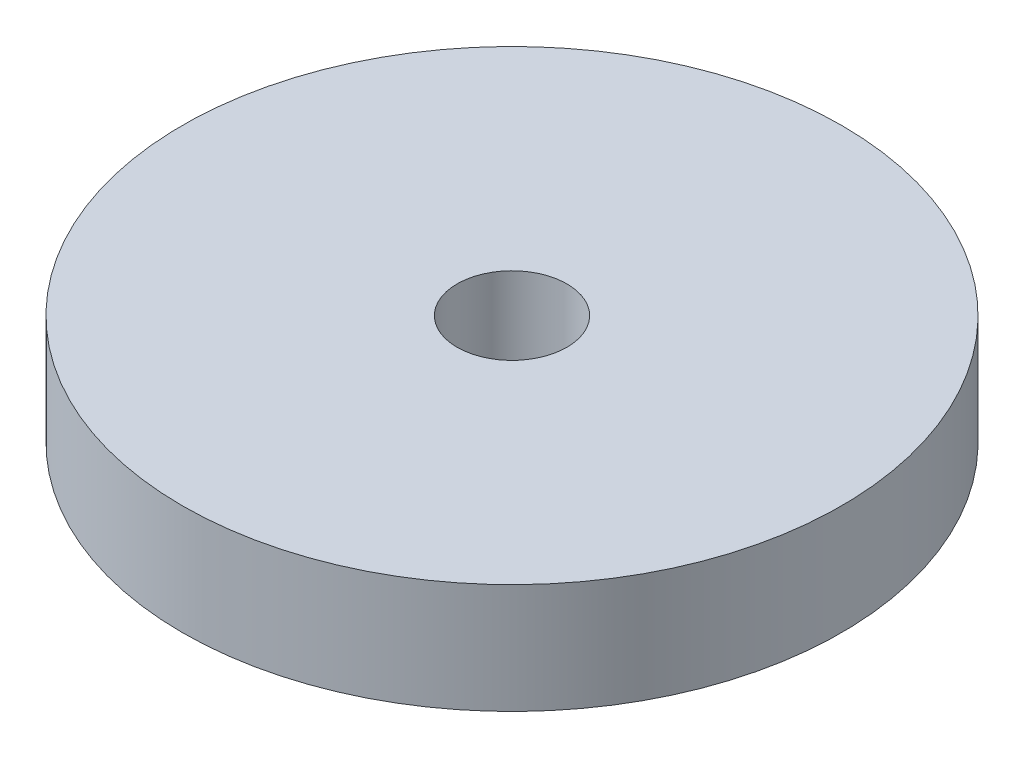
ISO-10303-21;
HEADER;
FILE_DESCRIPTION(('STEP AP214'),'2;1');
FILE_NAME('part.step','',(''),(''),'','','');
FILE_SCHEMA(('AUTOMOTIVE_DESIGN { 1 0 10303 214 1 1 1 1 }'));
ENDSEC;
DATA;
#1=APPLICATION_CONTEXT('core data for automotive mechanical design processes');
#2=APPLICATION_PROTOCOL_DEFINITION('international standard','automotive_design',2000,#1);
#3=PRODUCT_CONTEXT('',#1,'mechanical');
#4=PRODUCT('Part','Part','',(#3));
#5=PRODUCT_RELATED_PRODUCT_CATEGORY('part','',(#4));
#6=PRODUCT_DEFINITION_FORMATION('','',#4);
#7=PRODUCT_DEFINITION_CONTEXT('part definition',#1,'design');
#8=PRODUCT_DEFINITION('design','',#6,#7);
#9=PRODUCT_DEFINITION_SHAPE('','',#8);
#10=(LENGTH_UNIT() NAMED_UNIT(*) SI_UNIT(.MILLI.,.METRE.));
#11=(NAMED_UNIT(*) PLANE_ANGLE_UNIT() SI_UNIT($,.RADIAN.));
#12=(NAMED_UNIT(*) SI_UNIT($,.STERADIAN.) SOLID_ANGLE_UNIT());
#13=UNCERTAINTY_MEASURE_WITH_UNIT(LENGTH_MEASURE(1.E-05),#10,'distance_accuracy_value','');
#14=(GEOMETRIC_REPRESENTATION_CONTEXT(3) GLOBAL_UNCERTAINTY_ASSIGNED_CONTEXT((#13)) GLOBAL_UNIT_ASSIGNED_CONTEXT((#10,
#11,#12)) REPRESENTATION_CONTEXT('',''));
#15=CARTESIAN_POINT('',(0.,0.,0.));
#16=DIRECTION('',(0.,0.,1.));
#17=DIRECTION('',(1.,0.,0.));
#18=AXIS2_PLACEMENT_3D('',#15,#16,#17);
#19=CARTESIAN_POINT('',(0.,3.175,0.));
#20=DIRECTION('',(0.,1.,0.));
#21=DIRECTION('',(0.,0.,1.));
#22=AXIS2_PLACEMENT_3D('',#19,#20,#21);
#23=PLANE('',#22);
#24=CARTESIAN_POINT('',(0.,3.175,0.));
#25=DIRECTION('',(0.,1.,0.));
#26=DIRECTION('',(0.,0.,1.));
#27=AXIS2_PLACEMENT_3D('',#24,#25,#26);
#28=CIRCLE('',#27,9.525);
#29=CARTESIAN_POINT('',(0.,3.175,9.525));
#30=VERTEX_POINT('',#29);
#31=EDGE_CURVE('E10',#30,#30,#28,.T.);
#32=ORIENTED_EDGE('',*,*,#31,.T.);
#33=EDGE_LOOP('',(#32));
#34=FACE_BOUND('',#33,.T.);
#35=CARTESIAN_POINT('',(0.,3.175,0.));
#36=DIRECTION('',(0.,1.,0.));
#37=DIRECTION('',(0.,0.,1.));
#38=AXIS2_PLACEMENT_3D('',#35,#36,#37);
#39=CIRCLE('',#38,1.5875);
#40=CARTESIAN_POINT('',(0.,3.175,1.5875));
#41=VERTEX_POINT('',#40);
#42=EDGE_CURVE('E43',#41,#41,#39,.T.);
#43=ORIENTED_EDGE('',*,*,#42,.F.);
#44=EDGE_LOOP('',(#43));
#45=FACE_BOUND('',#44,.T.);
#46=ADVANCED_FACE('F32',(#34,#45),#23,.T.);
#47=CARTESIAN_POINT('',(0.,0.,0.));
#48=DIRECTION('',(0.,1.,0.));
#49=DIRECTION('',(0.,0.,1.));
#50=AXIS2_PLACEMENT_3D('',#47,#48,#49);
#51=PLANE('',#50);
#52=CARTESIAN_POINT('',(0.,0.,0.));
#53=DIRECTION('',(0.,1.,0.));
#54=DIRECTION('',(0.,0.,1.));
#55=AXIS2_PLACEMENT_3D('',#52,#53,#54);
#56=CIRCLE('',#55,9.525);
#57=CARTESIAN_POINT('',(0.,0.,9.525));
#58=VERTEX_POINT('',#57);
#59=EDGE_CURVE('E36',#58,#58,#56,.T.);
#60=ORIENTED_EDGE('',*,*,#59,.F.);
#61=EDGE_LOOP('',(#60));
#62=FACE_BOUND('',#61,.T.);
#63=CARTESIAN_POINT('',(0.,0.,0.));
#64=DIRECTION('',(0.,1.,0.));
#65=DIRECTION('',(0.,0.,1.));
#66=AXIS2_PLACEMENT_3D('',#63,#64,#65);
#67=CIRCLE('',#66,1.5875);
#68=CARTESIAN_POINT('',(0.,0.,1.5875));
#69=VERTEX_POINT('',#68);
#70=EDGE_CURVE('E45',#69,#69,#67,.T.);
#71=ORIENTED_EDGE('',*,*,#70,.T.);
#72=EDGE_LOOP('',(#71));
#73=FACE_BOUND('',#72,.T.);
#74=ADVANCED_FACE('F55',(#62,#73),#51,.F.);
#75=CARTESIAN_POINT('',(0.,3.175,0.));
#76=DIRECTION('',(0.,-1.,0.));
#77=DIRECTION('',(0.,0.,-1.));
#78=AXIS2_PLACEMENT_3D('',#75,#76,#77);
#79=CYLINDRICAL_SURFACE('',#78,9.525);
#80=ORIENTED_EDGE('',*,*,#31,.F.);
#81=EDGE_LOOP('',(#80));
#82=FACE_BOUND('',#81,.T.);
#83=ORIENTED_EDGE('',*,*,#59,.T.);
#84=EDGE_LOOP('',(#83));
#85=FACE_BOUND('',#84,.T.);
#86=ADVANCED_FACE('F34',(#82,#85),#79,.T.);
#87=CARTESIAN_POINT('',(0.,3.175,0.));
#88=DIRECTION('',(0.,-1.,0.));
#89=DIRECTION('',(0.,0.,-1.));
#90=AXIS2_PLACEMENT_3D('',#87,#88,#89);
#91=CYLINDRICAL_SURFACE('',#90,1.5875);
#92=ORIENTED_EDGE('',*,*,#42,.T.);
#93=EDGE_LOOP('',(#92));
#94=FACE_BOUND('',#93,.T.);
#95=ORIENTED_EDGE('',*,*,#70,.F.);
#96=EDGE_LOOP('',(#95));
#97=FACE_BOUND('',#96,.T.);
#98=ADVANCED_FACE('F51',(#94,#97),#91,.F.);
#99=CLOSED_SHELL('',(#46,#74,#86,#98));
#100=MANIFOLD_SOLID_BREP('B2',#99);
#101=ADVANCED_BREP_SHAPE_REPRESENTATION('',(#18,#100),#14);
#102=SHAPE_DEFINITION_REPRESENTATION(#9,#101);
ENDSEC;
END-ISO-10303-21;
